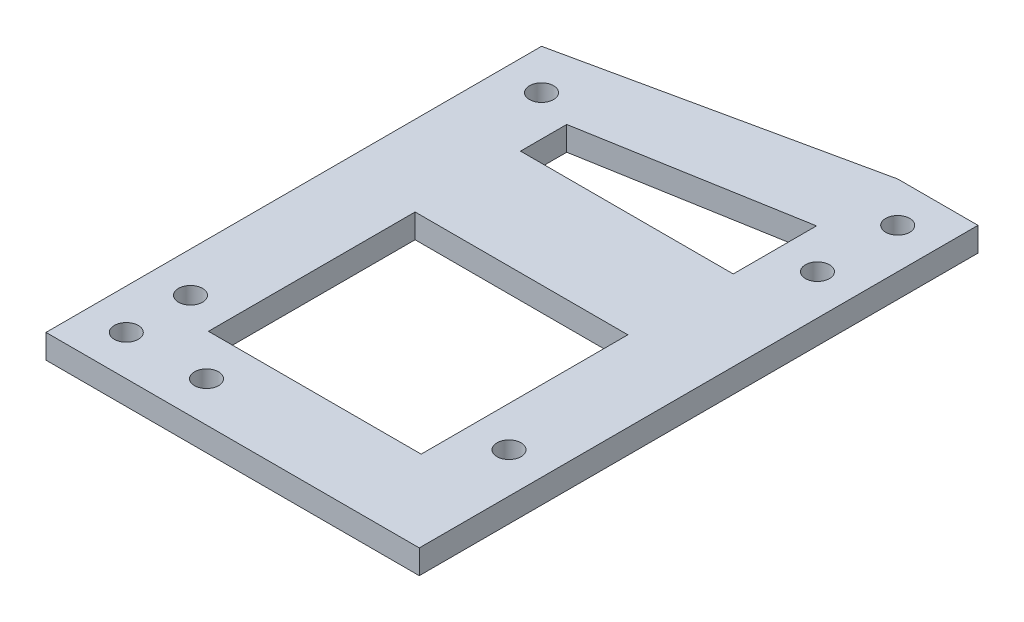
ISO-10303-21;
HEADER;
FILE_DESCRIPTION(('STEP AP214'),'2;1');
FILE_NAME('part.step','',(''),(''),'','','');
FILE_SCHEMA(('AUTOMOTIVE_DESIGN { 1 0 10303 214 1 1 1 1 }'));
ENDSEC;
DATA;
#1=APPLICATION_CONTEXT('core data for automotive mechanical design processes');
#2=APPLICATION_PROTOCOL_DEFINITION('international standard','automotive_design',2000,#1);
#3=PRODUCT_CONTEXT('',#1,'mechanical');
#4=PRODUCT('Part','Part','',(#3));
#5=PRODUCT_RELATED_PRODUCT_CATEGORY('part','',(#4));
#6=PRODUCT_DEFINITION_FORMATION('','',#4);
#7=PRODUCT_DEFINITION_CONTEXT('part definition',#1,'design');
#8=PRODUCT_DEFINITION('design','',#6,#7);
#9=PRODUCT_DEFINITION_SHAPE('','',#8);
#10=(LENGTH_UNIT() NAMED_UNIT(*) SI_UNIT(.MILLI.,.METRE.));
#11=(NAMED_UNIT(*) PLANE_ANGLE_UNIT() SI_UNIT($,.RADIAN.));
#12=(NAMED_UNIT(*) SI_UNIT($,.STERADIAN.) SOLID_ANGLE_UNIT());
#13=UNCERTAINTY_MEASURE_WITH_UNIT(LENGTH_MEASURE(1.E-05),#10,'distance_accuracy_value','');
#14=(GEOMETRIC_REPRESENTATION_CONTEXT(3) GLOBAL_UNCERTAINTY_ASSIGNED_CONTEXT((#13)) GLOBAL_UNIT_ASSIGNED_CONTEXT((#10,
#11,#12)) REPRESENTATION_CONTEXT('',''));
#15=CARTESIAN_POINT('',(0.,0.,0.));
#16=DIRECTION('',(0.,0.,1.));
#17=DIRECTION('',(1.,0.,0.));
#18=AXIS2_PLACEMENT_3D('',#15,#16,#17);
#19=CARTESIAN_POINT('',(31.5,3.,0.));
#20=DIRECTION('',(1.,0.,0.));
#21=DIRECTION('',(0.,0.,-1.));
#22=AXIS2_PLACEMENT_3D('',#19,#20,#21);
#23=PLANE('',#22);
#24=DIRECTION('',(0.,0.,1.));
#25=VECTOR('',#24,1.);
#26=CARTESIAN_POINT('',(31.5,0.,0.));
#27=LINE('',#26,#25);
#28=CARTESIAN_POINT('',(31.5,0.,-54.4800000000001));
#29=VERTEX_POINT('',#28);
#30=CARTESIAN_POINT('',(31.5,0.,-44.1090614886732));
#31=VERTEX_POINT('',#30);
#32=EDGE_CURVE('E222',#29,#31,#27,.T.);
#33=ORIENTED_EDGE('',*,*,#32,.T.);
#34=DIRECTION('',(0.,1.,0.));
#35=VECTOR('',#34,1.);
#36=CARTESIAN_POINT('',(31.5,0.,-44.1090614886732));
#37=LINE('',#36,#35);
#38=CARTESIAN_POINT('',(31.5,3.,-44.1090614886732));
#39=VERTEX_POINT('',#38);
#40=EDGE_CURVE('E166',#31,#39,#37,.T.);
#41=ORIENTED_EDGE('',*,*,#40,.T.);
#42=DIRECTION('',(0.,0.,1.));
#43=VECTOR('',#42,1.);
#44=CARTESIAN_POINT('',(31.5,3.,0.));
#45=LINE('',#44,#43);
#46=CARTESIAN_POINT('',(31.5,3.,-54.4800000000001));
#47=VERTEX_POINT('',#46);
#48=EDGE_CURVE('E159',#47,#39,#45,.T.);
#49=ORIENTED_EDGE('',*,*,#48,.F.);
#50=DIRECTION('',(0.,-1.,0.));
#51=VECTOR('',#50,1.);
#52=CARTESIAN_POINT('',(31.5,3.,-54.4800000000001));
#53=LINE('',#52,#51);
#54=EDGE_CURVE('E143',#47,#29,#53,.T.);
#55=ORIENTED_EDGE('',*,*,#54,.T.);
#56=EDGE_LOOP('',(#33,#41,#49,#55));
#57=FACE_BOUND('',#56,.T.);
#58=ADVANCED_FACE('F45',(#57),#23,.F.);
#59=CARTESIAN_POINT('',(5.,3.,0.));
#60=DIRECTION('',(1.,0.,0.));
#61=DIRECTION('',(0.,0.,-1.));
#62=AXIS2_PLACEMENT_3D('',#59,#60,#61);
#63=PLANE('',#62);
#64=DIRECTION('',(0.,1.,0.));
#65=VECTOR('',#64,1.);
#66=CARTESIAN_POINT('',(5.,0.,-49.8670785525155));
#67=LINE('',#66,#65);
#68=CARTESIAN_POINT('',(5.,0.,-49.8670785525155));
#69=VERTEX_POINT('',#68);
#70=CARTESIAN_POINT('',(5.,3.,-49.8670785525155));
#71=VERTEX_POINT('',#70);
#72=EDGE_CURVE('E263',#69,#71,#67,.T.);
#73=ORIENTED_EDGE('',*,*,#72,.T.);
#74=DIRECTION('',(0.,0.,1.));
#75=VECTOR('',#74,1.);
#76=CARTESIAN_POINT('',(5.,3.,0.));
#77=LINE('',#76,#75);
#78=CARTESIAN_POINT('',(5.,3.,-44.1090614886732));
#79=VERTEX_POINT('',#78);
#80=EDGE_CURVE('E161',#71,#79,#77,.T.);
#81=ORIENTED_EDGE('',*,*,#80,.T.);
#82=DIRECTION('',(0.,1.,0.));
#83=VECTOR('',#82,1.);
#84=CARTESIAN_POINT('',(5.,0.,-44.1090614886732));
#85=LINE('',#84,#83);
#86=CARTESIAN_POINT('',(5.,0.,-44.1090614886732));
#87=VERTEX_POINT('',#86);
#88=EDGE_CURVE('E195',#87,#79,#85,.T.);
#89=ORIENTED_EDGE('',*,*,#88,.F.);
#90=DIRECTION('',(0.,0.,1.));
#91=VECTOR('',#90,1.);
#92=CARTESIAN_POINT('',(5.,0.,0.));
#93=LINE('',#92,#91);
#94=EDGE_CURVE('E230',#69,#87,#93,.T.);
#95=ORIENTED_EDGE('',*,*,#94,.F.);
#96=EDGE_LOOP('',(#73,#81,#89,#95));
#97=FACE_BOUND('',#96,.T.);
#98=ADVANCED_FACE('F365',(#97),#63,.T.);
#99=CARTESIAN_POINT('',(31.5,3.,-30.982012269488));
#100=VERTEX_POINT('',#99);
#101=CARTESIAN_POINT('',(31.5,3.,-5.23402453897604));
#102=VERTEX_POINT('',#101);
#103=EDGE_CURVE('E71',#100,#102,#45,.T.);
#104=ORIENTED_EDGE('',*,*,#103,.F.);
#105=DIRECTION('',(0.,1.,0.));
#106=VECTOR('',#105,1.);
#107=CARTESIAN_POINT('',(31.5,0.,-30.982012269488));
#108=LINE('',#107,#106);
#109=CARTESIAN_POINT('',(31.5,0.,-30.982012269488));
#110=VERTEX_POINT('',#109);
#111=EDGE_CURVE('E301',#110,#100,#108,.T.);
#112=ORIENTED_EDGE('',*,*,#111,.F.);
#113=CARTESIAN_POINT('',(31.5,0.,-5.23402453897604));
#114=VERTEX_POINT('',#113);
#115=EDGE_CURVE('E221',#110,#114,#27,.T.);
#116=ORIENTED_EDGE('',*,*,#115,.T.);
#117=DIRECTION('',(0.,-1.,0.));
#118=VECTOR('',#117,1.);
#119=CARTESIAN_POINT('',(31.5,3.,-5.23402453897604));
#120=LINE('',#119,#118);
#121=EDGE_CURVE('E11',#102,#114,#120,.T.);
#122=ORIENTED_EDGE('',*,*,#121,.F.);
#123=EDGE_LOOP('',(#104,#112,#116,#122));
#124=FACE_BOUND('',#123,.T.);
#125=ADVANCED_FACE('F367',(#124),#23,.F.);
#126=CARTESIAN_POINT('',(0.,3.,-5.23402453897604));
#127=DIRECTION('',(0.,0.,-1.));
#128=DIRECTION('',(-1.,0.,0.));
#129=AXIS2_PLACEMENT_3D('',#126,#127,#128);
#130=PLANE('',#129);
#131=DIRECTION('',(1.,0.,0.));
#132=VECTOR('',#131,1.);
#133=CARTESIAN_POINT('',(0.,0.,-5.23402453897604));
#134=LINE('',#133,#132);
#135=CARTESIAN_POINT('',(5.,0.,-5.23402453897604));
#136=VERTEX_POINT('',#135);
#137=EDGE_CURVE('E225',#136,#114,#134,.T.);
#138=ORIENTED_EDGE('',*,*,#137,.F.);
#139=DIRECTION('',(0.,-1.,0.));
#140=VECTOR('',#139,1.);
#141=CARTESIAN_POINT('',(5.,3.,-5.23402453897604));
#142=LINE('',#141,#140);
#143=CARTESIAN_POINT('',(5.,3.,-5.23402453897604));
#144=VERTEX_POINT('',#143);
#145=EDGE_CURVE('E55',#144,#136,#142,.T.);
#146=ORIENTED_EDGE('',*,*,#145,.F.);
#147=DIRECTION('',(1.,0.,0.));
#148=VECTOR('',#147,1.);
#149=CARTESIAN_POINT('',(0.,3.,-5.23402453897604));
#150=LINE('',#149,#148);
#151=EDGE_CURVE('E168',#144,#102,#150,.T.);
#152=ORIENTED_EDGE('',*,*,#151,.T.);
#153=ORIENTED_EDGE('',*,*,#121,.T.);
#154=EDGE_LOOP('',(#138,#146,#152,#153));
#155=FACE_BOUND('',#154,.T.);
#156=ADVANCED_FACE('F377',(#155),#130,.T.);
#157=DIRECTION('',(0.,1.,0.));
#158=VECTOR('',#157,1.);
#159=CARTESIAN_POINT('',(5.,0.,-30.982012269488));
#160=LINE('',#159,#158);
#161=CARTESIAN_POINT('',(5.,0.,-30.982012269488));
#162=VERTEX_POINT('',#161);
#163=CARTESIAN_POINT('',(5.,3.,-30.982012269488));
#164=VERTEX_POINT('',#163);
#165=EDGE_CURVE('E290',#162,#164,#160,.T.);
#166=ORIENTED_EDGE('',*,*,#165,.T.);
#167=EDGE_CURVE('E173',#164,#144,#77,.T.);
#168=ORIENTED_EDGE('',*,*,#167,.T.);
#169=ORIENTED_EDGE('',*,*,#145,.T.);
#170=EDGE_CURVE('E229',#162,#136,#93,.T.);
#171=ORIENTED_EDGE('',*,*,#170,.F.);
#172=EDGE_LOOP('',(#166,#168,#169,#171));
#173=FACE_BOUND('',#172,.T.);
#174=ADVANCED_FACE('F373',(#173),#63,.T.);
#175=CARTESIAN_POINT('',(-5.,3.,0.));
#176=DIRECTION('',(1.,0.,0.));
#177=DIRECTION('',(0.,0.,-1.));
#178=AXIS2_PLACEMENT_3D('',#175,#176,#177);
#179=PLANE('',#178);
#180=DIRECTION('',(0.,0.,1.));
#181=VECTOR('',#180,1.);
#182=CARTESIAN_POINT('',(-5.,0.,0.));
#183=LINE('',#182,#181);
#184=CARTESIAN_POINT('',(-5.,0.,-56.73));
#185=VERTEX_POINT('',#184);
#186=CARTESIAN_POINT('',(-5.,0.,5.));
#187=VERTEX_POINT('',#186);
#188=EDGE_CURVE('E190',#185,#187,#183,.T.);
#189=ORIENTED_EDGE('',*,*,#188,.T.);
#190=DIRECTION('',(0.,-1.,0.));
#191=VECTOR('',#190,1.);
#192=CARTESIAN_POINT('',(-5.,3.,5.));
#193=LINE('',#192,#191);
#194=CARTESIAN_POINT('',(-5.,3.,5.));
#195=VERTEX_POINT('',#194);
#196=EDGE_CURVE('E151',#195,#187,#193,.T.);
#197=ORIENTED_EDGE('',*,*,#196,.F.);
#198=DIRECTION('',(0.,0.,1.));
#199=VECTOR('',#198,1.);
#200=CARTESIAN_POINT('',(-5.,3.,0.));
#201=LINE('',#200,#199);
#202=CARTESIAN_POINT('',(-5.,3.,-56.73));
#203=VERTEX_POINT('',#202);
#204=EDGE_CURVE('E240',#203,#195,#201,.T.);
#205=ORIENTED_EDGE('',*,*,#204,.F.);
#206=DIRECTION('',(0.,-1.,0.));
#207=VECTOR('',#206,1.);
#208=CARTESIAN_POINT('',(-5.,3.,-56.73));
#209=LINE('',#208,#207);
#210=EDGE_CURVE('E189',#203,#185,#209,.T.);
#211=ORIENTED_EDGE('',*,*,#210,.T.);
#212=EDGE_LOOP('',(#189,#197,#205,#211));
#213=FACE_BOUND('',#212,.T.);
#214=ADVANCED_FACE('F47',(#213),#179,.F.);
#215=CARTESIAN_POINT('',(0.,3.,5.));
#216=DIRECTION('',(0.,0.,-1.));
#217=DIRECTION('',(-1.,0.,0.));
#218=AXIS2_PLACEMENT_3D('',#215,#216,#217);
#219=PLANE('',#218);
#220=DIRECTION('',(1.,0.,0.));
#221=VECTOR('',#220,1.);
#222=CARTESIAN_POINT('',(0.,0.,5.));
#223=LINE('',#222,#221);
#224=CARTESIAN_POINT('',(41.5,0.,5.));
#225=VERTEX_POINT('',#224);
#226=EDGE_CURVE('E194',#187,#225,#223,.T.);
#227=ORIENTED_EDGE('',*,*,#226,.T.);
#228=DIRECTION('',(0.,-1.,0.));
#229=VECTOR('',#228,1.);
#230=CARTESIAN_POINT('',(41.5,3.,5.));
#231=LINE('',#230,#229);
#232=CARTESIAN_POINT('',(41.5,3.,5.));
#233=VERTEX_POINT('',#232);
#234=EDGE_CURVE('E255',#233,#225,#231,.T.);
#235=ORIENTED_EDGE('',*,*,#234,.F.);
#236=DIRECTION('',(1.,0.,0.));
#237=VECTOR('',#236,1.);
#238=CARTESIAN_POINT('',(0.,3.,5.));
#239=LINE('',#238,#237);
#240=EDGE_CURVE('E310',#195,#233,#239,.T.);
#241=ORIENTED_EDGE('',*,*,#240,.F.);
#242=ORIENTED_EDGE('',*,*,#196,.T.);
#243=EDGE_LOOP('',(#227,#235,#241,#242));
#244=FACE_BOUND('',#243,.T.);
#245=ADVANCED_FACE('F406',(#244),#219,.F.);
#246=CARTESIAN_POINT('',(41.5,3.,0.));
#247=DIRECTION('',(1.,0.,0.));
#248=DIRECTION('',(0.,0.,-1.));
#249=AXIS2_PLACEMENT_3D('',#246,#247,#248);
#250=PLANE('',#249);
#251=DIRECTION('',(0.,0.,1.));
#252=VECTOR('',#251,1.);
#253=CARTESIAN_POINT('',(41.5,0.,0.));
#254=LINE('',#253,#252);
#255=CARTESIAN_POINT('',(41.5,0.,-64.6));
#256=VERTEX_POINT('',#255);
#257=EDGE_CURVE('E199',#256,#225,#254,.T.);
#258=ORIENTED_EDGE('',*,*,#257,.F.);
#259=DIRECTION('',(0.,-1.,0.));
#260=VECTOR('',#259,1.);
#261=CARTESIAN_POINT('',(41.5,3.,-64.6));
#262=LINE('',#261,#260);
#263=CARTESIAN_POINT('',(41.5,3.,-64.6));
#264=VERTEX_POINT('',#263);
#265=EDGE_CURVE('E252',#264,#256,#262,.T.);
#266=ORIENTED_EDGE('',*,*,#265,.F.);
#267=DIRECTION('',(0.,0.,1.));
#268=VECTOR('',#267,1.);
#269=CARTESIAN_POINT('',(41.5,3.,0.));
#270=LINE('',#269,#268);
#271=EDGE_CURVE('E313',#264,#233,#270,.T.);
#272=ORIENTED_EDGE('',*,*,#271,.T.);
#273=ORIENTED_EDGE('',*,*,#234,.T.);
#274=EDGE_LOOP('',(#258,#266,#272,#273));
#275=FACE_BOUND('',#274,.T.);
#276=ADVANCED_FACE('F397',(#275),#250,.T.);
#277=CARTESIAN_POINT('',(0.,3.,-64.6));
#278=DIRECTION('',(0.,0.,1.));
#279=DIRECTION('',(1.,0.,0.));
#280=AXIS2_PLACEMENT_3D('',#277,#278,#279);
#281=PLANE('',#280);
#282=DIRECTION('',(-1.,0.,0.));
#283=VECTOR('',#282,1.);
#284=CARTESIAN_POINT('',(0.,0.,-64.6));
#285=LINE('',#284,#283);
#286=CARTESIAN_POINT('',(31.5,0.,-64.6));
#287=VERTEX_POINT('',#286);
#288=EDGE_CURVE('E203',#256,#287,#285,.T.);
#289=ORIENTED_EDGE('',*,*,#288,.T.);
#290=DIRECTION('',(0.,-1.,0.));
#291=VECTOR('',#290,1.);
#292=CARTESIAN_POINT('',(31.5,3.,-64.6));
#293=LINE('',#292,#291);
#294=CARTESIAN_POINT('',(31.5,3.,-64.6));
#295=VERTEX_POINT('',#294);
#296=EDGE_CURVE('E248',#295,#287,#293,.T.);
#297=ORIENTED_EDGE('',*,*,#296,.F.);
#298=DIRECTION('',(-1.,0.,0.));
#299=VECTOR('',#298,1.);
#300=CARTESIAN_POINT('',(0.,3.,-64.6));
#301=LINE('',#300,#299);
#302=EDGE_CURVE('E317',#264,#295,#301,.T.);
#303=ORIENTED_EDGE('',*,*,#302,.F.);
#304=ORIENTED_EDGE('',*,*,#265,.T.);
#305=EDGE_LOOP('',(#289,#297,#303,#304));
#306=FACE_BOUND('',#305,.T.);
#307=ADVANCED_FACE('F390',(#306),#281,.F.);
#308=CARTESIAN_POINT('',(0.,3.,-51.73));
#309=DIRECTION('',(0.,-1.,0.));
#310=DIRECTION('',(0.,0.,-1.));
#311=AXIS2_PLACEMENT_3D('',#308,#309,#310);
#312=CYLINDRICAL_SURFACE('',#311,1.5);
#313=CARTESIAN_POINT('',(0.,3.,-51.73));
#314=DIRECTION('',(0.,1.,0.));
#315=DIRECTION('',(0.,0.,1.));
#316=AXIS2_PLACEMENT_3D('',#313,#314,#315);
#317=CIRCLE('',#316,1.5);
#318=CARTESIAN_POINT('',(0.,3.,-50.23));
#319=VERTEX_POINT('',#318);
#320=EDGE_CURVE('E181',#319,#319,#317,.T.);
#321=ORIENTED_EDGE('',*,*,#320,.T.);
#322=EDGE_LOOP('',(#321));
#323=FACE_BOUND('',#322,.T.);
#324=CARTESIAN_POINT('',(0.,0.,-51.73));
#325=DIRECTION('',(0.,1.,0.));
#326=DIRECTION('',(0.,0.,1.));
#327=AXIS2_PLACEMENT_3D('',#324,#325,#326);
#328=CIRCLE('',#327,1.5);
#329=CARTESIAN_POINT('',(0.,0.,-50.23));
#330=VERTEX_POINT('',#329);
#331=EDGE_CURVE('E233',#330,#330,#328,.T.);
#332=ORIENTED_EDGE('',*,*,#331,.F.);
#333=EDGE_LOOP('',(#332));
#334=FACE_BOUND('',#333,.T.);
#335=ADVANCED_FACE('F388',(#323,#334),#312,.F.);
#336=CARTESIAN_POINT('',(36.5,3.,-49.6));
#337=DIRECTION('',(0.,-1.,0.));
#338=DIRECTION('',(0.,0.,-1.));
#339=AXIS2_PLACEMENT_3D('',#336,#337,#338);
#340=CYLINDRICAL_SURFACE('',#339,1.5);
#341=CARTESIAN_POINT('',(36.5,3.,-49.6));
#342=DIRECTION('',(0.,1.,0.));
#343=DIRECTION('',(0.,0.,1.));
#344=AXIS2_PLACEMENT_3D('',#341,#342,#343);
#345=CIRCLE('',#344,1.5);
#346=CARTESIAN_POINT('',(36.5,3.,-48.1));
#347=VERTEX_POINT('',#346);
#348=EDGE_CURVE('E175',#347,#347,#345,.T.);
#349=ORIENTED_EDGE('',*,*,#348,.T.);
#350=EDGE_LOOP('',(#349));
#351=FACE_BOUND('',#350,.T.);
#352=CARTESIAN_POINT('',(36.5,0.,-49.6));
#353=DIRECTION('',(0.,1.,0.));
#354=DIRECTION('',(0.,0.,1.));
#355=AXIS2_PLACEMENT_3D('',#352,#353,#354);
#356=CIRCLE('',#355,1.5);
#357=CARTESIAN_POINT('',(36.5,0.,-48.1));
#358=VERTEX_POINT('',#357);
#359=EDGE_CURVE('E217',#358,#358,#356,.T.);
#360=ORIENTED_EDGE('',*,*,#359,.F.);
#361=EDGE_LOOP('',(#360));
#362=FACE_BOUND('',#361,.T.);
#363=ADVANCED_FACE('F335',(#351,#362),#340,.F.);
#364=CARTESIAN_POINT('',(36.5,3.,-59.6));
#365=DIRECTION('',(0.,-1.,0.));
#366=DIRECTION('',(0.,0.,-1.));
#367=AXIS2_PLACEMENT_3D('',#364,#365,#366);
#368=CYLINDRICAL_SURFACE('',#367,1.5);
#369=CARTESIAN_POINT('',(36.5,3.,-59.6));
#370=DIRECTION('',(0.,1.,0.));
#371=DIRECTION('',(0.,0.,1.));
#372=AXIS2_PLACEMENT_3D('',#369,#370,#371);
#373=CIRCLE('',#372,1.5);
#374=CARTESIAN_POINT('',(36.5,3.,-58.1));
#375=VERTEX_POINT('',#374);
#376=EDGE_CURVE('E326',#375,#375,#373,.T.);
#377=ORIENTED_EDGE('',*,*,#376,.T.);
#378=EDGE_LOOP('',(#377));
#379=FACE_BOUND('',#378,.T.);
#380=CARTESIAN_POINT('',(36.5,0.,-59.6));
#381=DIRECTION('',(0.,1.,0.));
#382=DIRECTION('',(0.,0.,1.));
#383=AXIS2_PLACEMENT_3D('',#380,#381,#382);
#384=CIRCLE('',#383,1.5);
#385=CARTESIAN_POINT('',(36.5,0.,-58.1));
#386=VERTEX_POINT('',#385);
#387=EDGE_CURVE('E213',#386,#386,#384,.T.);
#388=ORIENTED_EDGE('',*,*,#387,.F.);
#389=EDGE_LOOP('',(#388));
#390=FACE_BOUND('',#389,.T.);
#391=ADVANCED_FACE('F396',(#379,#390),#368,.F.);
#392=CARTESIAN_POINT('',(36.5,3.,-11.18));
#393=DIRECTION('',(0.,-1.,0.));
#394=DIRECTION('',(0.,0.,-1.));
#395=AXIS2_PLACEMENT_3D('',#392,#393,#394);
#396=CYLINDRICAL_SURFACE('',#395,1.5);
#397=CARTESIAN_POINT('',(36.5,3.,-11.18));
#398=DIRECTION('',(0.,1.,0.));
#399=DIRECTION('',(0.,0.,1.));
#400=AXIS2_PLACEMENT_3D('',#397,#398,#399);
#401=CIRCLE('',#400,1.5);
#402=CARTESIAN_POINT('',(36.5,3.,-9.67999999999999));
#403=VERTEX_POINT('',#402);
#404=EDGE_CURVE('E323',#403,#403,#401,.T.);
#405=ORIENTED_EDGE('',*,*,#404,.T.);
#406=EDGE_LOOP('',(#405));
#407=FACE_BOUND('',#406,.T.);
#408=CARTESIAN_POINT('',(36.5,0.,-11.18));
#409=DIRECTION('',(0.,1.,0.));
#410=DIRECTION('',(0.,0.,1.));
#411=AXIS2_PLACEMENT_3D('',#408,#409,#410);
#412=CIRCLE('',#411,1.5);
#413=CARTESIAN_POINT('',(36.5,0.,-9.67999999999999));
#414=VERTEX_POINT('',#413);
#415=EDGE_CURVE('E209',#414,#414,#412,.T.);
#416=ORIENTED_EDGE('',*,*,#415,.F.);
#417=EDGE_LOOP('',(#416));
#418=FACE_BOUND('',#417,.T.);
#419=ADVANCED_FACE('F435',(#407,#418),#396,.F.);
#420=CARTESIAN_POINT('',(-11.9106417152535,3.,-55.2399520466015));
#421=DIRECTION('',(0.210772639150553,0.,0.97753511168935));
#422=DIRECTION('',(0.977535111689351,0.,-0.210772639150553));
#423=AXIS2_PLACEMENT_3D('',#420,#421,#422);
#424=PLANE('',#423);
#425=DIRECTION('',(-0.977535111689351,0.,0.210772639150553));
#426=VECTOR('',#425,1.);
#427=CARTESIAN_POINT('',(-11.9106417152535,0.,-55.2399520466015));
#428=LINE('',#427,#426);
#429=EDGE_CURVE('E206',#287,#185,#428,.T.);
#430=ORIENTED_EDGE('',*,*,#429,.T.);
#431=ORIENTED_EDGE('',*,*,#210,.F.);
#432=DIRECTION('',(-0.977535111689351,0.,0.210772639150553));
#433=VECTOR('',#432,1.);
#434=CARTESIAN_POINT('',(-11.9106417152535,3.,-55.2399520466015));
#435=LINE('',#434,#433);
#436=EDGE_CURVE('E320',#295,#203,#435,.T.);
#437=ORIENTED_EDGE('',*,*,#436,.F.);
#438=ORIENTED_EDGE('',*,*,#296,.T.);
#439=EDGE_LOOP('',(#430,#431,#437,#438));
#440=FACE_BOUND('',#439,.T.);
#441=ADVANCED_FACE('F350',(#440),#424,.F.);
#442=CARTESIAN_POINT('',(0.,3.,0.));
#443=DIRECTION('',(0.,-1.,0.));
#444=DIRECTION('',(0.,0.,-1.));
#445=AXIS2_PLACEMENT_3D('',#442,#443,#444);
#446=CYLINDRICAL_SURFACE('',#445,1.5);
#447=CARTESIAN_POINT('',(0.,3.,0.));
#448=DIRECTION('',(0.,1.,0.));
#449=DIRECTION('',(0.,0.,1.));
#450=AXIS2_PLACEMENT_3D('',#447,#448,#449);
#451=CIRCLE('',#450,1.5);
#452=CARTESIAN_POINT('',(0.,3.,1.5));
#453=VERTEX_POINT('',#452);
#454=EDGE_CURVE('E185',#453,#453,#451,.T.);
#455=ORIENTED_EDGE('',*,*,#454,.T.);
#456=EDGE_LOOP('',(#455));
#457=FACE_BOUND('',#456,.T.);
#458=CARTESIAN_POINT('',(0.,0.,0.));
#459=DIRECTION('',(0.,1.,0.));
#460=DIRECTION('',(0.,0.,1.));
#461=AXIS2_PLACEMENT_3D('',#458,#459,#460);
#462=CIRCLE('',#461,1.5);
#463=CARTESIAN_POINT('',(0.,0.,1.5));
#464=VERTEX_POINT('',#463);
#465=EDGE_CURVE('E237',#464,#464,#462,.T.);
#466=ORIENTED_EDGE('',*,*,#465,.F.);
#467=EDGE_LOOP('',(#466));
#468=FACE_BOUND('',#467,.T.);
#469=ADVANCED_FACE('F341',(#457,#468),#446,.F.);
#470=CARTESIAN_POINT('',(0.,3.,0.));
#471=DIRECTION('',(0.,1.,0.));
#472=DIRECTION('',(0.,0.,1.));
#473=AXIS2_PLACEMENT_3D('',#470,#471,#472);
#474=PLANE('',#473);
#475=CARTESIAN_POINT('',(0.,3.,-8.));
#476=DIRECTION('',(0.,1.,0.));
#477=DIRECTION('',(0.,0.,1.));
#478=AXIS2_PLACEMENT_3D('',#475,#476,#477);
#479=CIRCLE('',#478,1.5);
#480=CARTESIAN_POINT('',(0.,3.,-6.5));
#481=VERTEX_POINT('',#480);
#482=EDGE_CURVE('E276',#481,#481,#479,.T.);
#483=ORIENTED_EDGE('',*,*,#482,.F.);
#484=EDGE_LOOP('',(#483));
#485=FACE_BOUND('',#484,.T.);
#486=CARTESIAN_POINT('',(10.,3.,0.));
#487=DIRECTION('',(0.,1.,0.));
#488=DIRECTION('',(0.,0.,1.));
#489=AXIS2_PLACEMENT_3D('',#486,#487,#488);
#490=CIRCLE('',#489,1.5);
#491=CARTESIAN_POINT('',(10.,3.,1.5));
#492=VERTEX_POINT('',#491);
#493=EDGE_CURVE('E264',#492,#492,#490,.T.);
#494=ORIENTED_EDGE('',*,*,#493,.F.);
#495=EDGE_LOOP('',(#494));
#496=FACE_BOUND('',#495,.T.);
#497=DIRECTION('',(0.985185223123837,0.,-0.17149366209407));
#498=VECTOR('',#497,1.);
#499=CARTESIAN_POINT('',(5.,3.,-49.8670785525155));
#500=LINE('',#499,#498);
#501=EDGE_CURVE('E146',#71,#47,#500,.T.);
#502=ORIENTED_EDGE('',*,*,#501,.T.);
#503=ORIENTED_EDGE('',*,*,#48,.T.);
#504=DIRECTION('',(-1.,0.,0.));
#505=VECTOR('',#504,1.);
#506=CARTESIAN_POINT('',(5.,3.,-44.1090614886732));
#507=LINE('',#506,#505);
#508=EDGE_CURVE('E286',#39,#79,#507,.T.);
#509=ORIENTED_EDGE('',*,*,#508,.T.);
#510=ORIENTED_EDGE('',*,*,#80,.F.);
#511=EDGE_LOOP('',(#502,#503,#509,#510));
#512=FACE_BOUND('',#511,.T.);
#513=ORIENTED_EDGE('',*,*,#167,.F.);
#514=DIRECTION('',(1.,0.,0.));
#515=VECTOR('',#514,1.);
#516=CARTESIAN_POINT('',(31.5,3.,-30.982012269488));
#517=LINE('',#516,#515);
#518=EDGE_CURVE('E163',#164,#100,#517,.T.);
#519=ORIENTED_EDGE('',*,*,#518,.T.);
#520=ORIENTED_EDGE('',*,*,#103,.T.);
#521=ORIENTED_EDGE('',*,*,#151,.F.);
#522=EDGE_LOOP('',(#513,#519,#520,#521));
#523=FACE_BOUND('',#522,.T.);
#524=ORIENTED_EDGE('',*,*,#204,.T.);
#525=ORIENTED_EDGE('',*,*,#240,.T.);
#526=ORIENTED_EDGE('',*,*,#271,.F.);
#527=ORIENTED_EDGE('',*,*,#302,.T.);
#528=ORIENTED_EDGE('',*,*,#436,.T.);
#529=EDGE_LOOP('',(#524,#525,#526,#527,#528));
#530=FACE_BOUND('',#529,.T.);
#531=ORIENTED_EDGE('',*,*,#404,.F.);
#532=EDGE_LOOP('',(#531));
#533=FACE_BOUND('',#532,.T.);
#534=ORIENTED_EDGE('',*,*,#376,.F.);
#535=EDGE_LOOP('',(#534));
#536=FACE_BOUND('',#535,.T.);
#537=ORIENTED_EDGE('',*,*,#348,.F.);
#538=EDGE_LOOP('',(#537));
#539=FACE_BOUND('',#538,.T.);
#540=ORIENTED_EDGE('',*,*,#320,.F.);
#541=EDGE_LOOP('',(#540));
#542=FACE_BOUND('',#541,.T.);
#543=ORIENTED_EDGE('',*,*,#454,.F.);
#544=EDGE_LOOP('',(#543));
#545=FACE_BOUND('',#544,.T.);
#546=ADVANCED_FACE('F156',(#485,#496,#512,#523,#530,#533,#536,#539,#542,#545),#474,.T.);
#547=CARTESIAN_POINT('',(0.,0.,0.));
#548=DIRECTION('',(0.,1.,0.));
#549=DIRECTION('',(0.,0.,1.));
#550=AXIS2_PLACEMENT_3D('',#547,#548,#549);
#551=PLANE('',#550);
#552=CARTESIAN_POINT('',(0.,0.,-8.));
#553=DIRECTION('',(0.,1.,0.));
#554=DIRECTION('',(0.,0.,1.));
#555=AXIS2_PLACEMENT_3D('',#552,#553,#554);
#556=CIRCLE('',#555,1.5);
#557=CARTESIAN_POINT('',(0.,0.,-6.5));
#558=VERTEX_POINT('',#557);
#559=EDGE_CURVE('E49',#558,#558,#556,.T.);
#560=ORIENTED_EDGE('',*,*,#559,.T.);
#561=EDGE_LOOP('',(#560));
#562=FACE_BOUND('',#561,.T.);
#563=CARTESIAN_POINT('',(10.,0.,0.));
#564=DIRECTION('',(0.,1.,0.));
#565=DIRECTION('',(0.,0.,1.));
#566=AXIS2_PLACEMENT_3D('',#563,#564,#565);
#567=CIRCLE('',#566,1.5);
#568=CARTESIAN_POINT('',(10.,0.,1.5));
#569=VERTEX_POINT('',#568);
#570=EDGE_CURVE('E260',#569,#569,#567,.T.);
#571=ORIENTED_EDGE('',*,*,#570,.T.);
#572=EDGE_LOOP('',(#571));
#573=FACE_BOUND('',#572,.T.);
#574=ORIENTED_EDGE('',*,*,#32,.F.);
#575=DIRECTION('',(0.985185223123837,0.,-0.17149366209407));
#576=VECTOR('',#575,1.);
#577=CARTESIAN_POINT('',(5.,0.,-49.8670785525155));
#578=LINE('',#577,#576);
#579=EDGE_CURVE('E63',#69,#29,#578,.T.);
#580=ORIENTED_EDGE('',*,*,#579,.F.);
#581=ORIENTED_EDGE('',*,*,#94,.T.);
#582=DIRECTION('',(-1.,0.,0.));
#583=VECTOR('',#582,1.);
#584=CARTESIAN_POINT('',(5.,0.,-44.1090614886732));
#585=LINE('',#584,#583);
#586=EDGE_CURVE('E285',#31,#87,#585,.T.);
#587=ORIENTED_EDGE('',*,*,#586,.F.);
#588=EDGE_LOOP('',(#574,#580,#581,#587));
#589=FACE_BOUND('',#588,.T.);
#590=DIRECTION('',(1.,0.,0.));
#591=VECTOR('',#590,1.);
#592=CARTESIAN_POINT('',(31.5,0.,-30.982012269488));
#593=LINE('',#592,#591);
#594=EDGE_CURVE('E281',#162,#110,#593,.T.);
#595=ORIENTED_EDGE('',*,*,#594,.F.);
#596=ORIENTED_EDGE('',*,*,#170,.T.);
#597=ORIENTED_EDGE('',*,*,#137,.T.);
#598=ORIENTED_EDGE('',*,*,#115,.F.);
#599=EDGE_LOOP('',(#595,#596,#597,#598));
#600=FACE_BOUND('',#599,.T.);
#601=ORIENTED_EDGE('',*,*,#188,.F.);
#602=ORIENTED_EDGE('',*,*,#429,.F.);
#603=ORIENTED_EDGE('',*,*,#288,.F.);
#604=ORIENTED_EDGE('',*,*,#257,.T.);
#605=ORIENTED_EDGE('',*,*,#226,.F.);
#606=EDGE_LOOP('',(#601,#602,#603,#604,#605));
#607=FACE_BOUND('',#606,.T.);
#608=ORIENTED_EDGE('',*,*,#415,.T.);
#609=EDGE_LOOP('',(#608));
#610=FACE_BOUND('',#609,.T.);
#611=ORIENTED_EDGE('',*,*,#387,.T.);
#612=EDGE_LOOP('',(#611));
#613=FACE_BOUND('',#612,.T.);
#614=ORIENTED_EDGE('',*,*,#359,.T.);
#615=EDGE_LOOP('',(#614));
#616=FACE_BOUND('',#615,.T.);
#617=ORIENTED_EDGE('',*,*,#331,.T.);
#618=EDGE_LOOP('',(#617));
#619=FACE_BOUND('',#618,.T.);
#620=ORIENTED_EDGE('',*,*,#465,.T.);
#621=EDGE_LOOP('',(#620));
#622=FACE_BOUND('',#621,.T.);
#623=ADVANCED_FACE('F340',(#562,#573,#589,#600,#607,#610,#613,#616,#619,#622),#551,.F.);
#624=CARTESIAN_POINT('',(5.,0.,-44.1090614886732));
#625=DIRECTION('',(0.,0.,-1.));
#626=DIRECTION('',(-1.,0.,0.));
#627=AXIS2_PLACEMENT_3D('',#624,#625,#626);
#628=PLANE('',#627);
#629=ORIENTED_EDGE('',*,*,#508,.F.);
#630=ORIENTED_EDGE('',*,*,#40,.F.);
#631=ORIENTED_EDGE('',*,*,#586,.T.);
#632=ORIENTED_EDGE('',*,*,#88,.T.);
#633=EDGE_LOOP('',(#629,#630,#631,#632));
#634=FACE_BOUND('',#633,.T.);
#635=ADVANCED_FACE('F355',(#634),#628,.T.);
#636=CARTESIAN_POINT('',(31.5,0.,-30.982012269488));
#637=DIRECTION('',(0.,0.,1.));
#638=DIRECTION('',(1.,0.,0.));
#639=AXIS2_PLACEMENT_3D('',#636,#637,#638);
#640=PLANE('',#639);
#641=ORIENTED_EDGE('',*,*,#518,.F.);
#642=ORIENTED_EDGE('',*,*,#165,.F.);
#643=ORIENTED_EDGE('',*,*,#594,.T.);
#644=ORIENTED_EDGE('',*,*,#111,.T.);
#645=EDGE_LOOP('',(#641,#642,#643,#644));
#646=FACE_BOUND('',#645,.T.);
#647=ADVANCED_FACE('F361',(#646),#640,.T.);
#648=CARTESIAN_POINT('',(5.,0.,-49.8670785525155));
#649=DIRECTION('',(0.17149366209407,0.,0.985185223123837));
#650=DIRECTION('',(0.985185223123837,0.,-0.17149366209407));
#651=AXIS2_PLACEMENT_3D('',#648,#649,#650);
#652=PLANE('',#651);
#653=ORIENTED_EDGE('',*,*,#501,.F.);
#654=ORIENTED_EDGE('',*,*,#72,.F.);
#655=ORIENTED_EDGE('',*,*,#579,.T.);
#656=ORIENTED_EDGE('',*,*,#54,.F.);
#657=EDGE_LOOP('',(#653,#654,#655,#656));
#658=FACE_BOUND('',#657,.T.);
#659=ADVANCED_FACE('F145',(#658),#652,.T.);
#660=CARTESIAN_POINT('',(10.,-7.,0.));
#661=DIRECTION('',(0.,1.,0.));
#662=DIRECTION('',(0.,0.,1.));
#663=AXIS2_PLACEMENT_3D('',#660,#661,#662);
#664=CYLINDRICAL_SURFACE('',#663,1.5);
#665=ORIENTED_EDGE('',*,*,#493,.T.);
#666=EDGE_LOOP('',(#665));
#667=FACE_BOUND('',#666,.T.);
#668=ORIENTED_EDGE('',*,*,#570,.F.);
#669=EDGE_LOOP('',(#668));
#670=FACE_BOUND('',#669,.T.);
#671=ADVANCED_FACE('F537',(#667,#670),#664,.F.);
#672=CARTESIAN_POINT('',(0.,-7.,-8.));
#673=DIRECTION('',(0.,1.,0.));
#674=DIRECTION('',(0.,0.,1.));
#675=AXIS2_PLACEMENT_3D('',#672,#673,#674);
#676=CYLINDRICAL_SURFACE('',#675,1.5);
#677=ORIENTED_EDGE('',*,*,#482,.T.);
#678=EDGE_LOOP('',(#677));
#679=FACE_BOUND('',#678,.T.);
#680=ORIENTED_EDGE('',*,*,#559,.F.);
#681=EDGE_LOOP('',(#680));
#682=FACE_BOUND('',#681,.T.);
#683=ADVANCED_FACE('F547',(#679,#682),#676,.F.);
#684=CLOSED_SHELL('',(#58,#98,#125,#156,#174,#214,#245,#276,#307,#335,#363,#391,#419,#441,#469,
#546,#623,#635,#647,#659,#671,#683));
#685=MANIFOLD_SOLID_BREP('B2',#684);
#686=ADVANCED_BREP_SHAPE_REPRESENTATION('',(#18,#685),#14);
#687=SHAPE_DEFINITION_REPRESENTATION(#9,#686);
ENDSEC;
END-ISO-10303-21;
